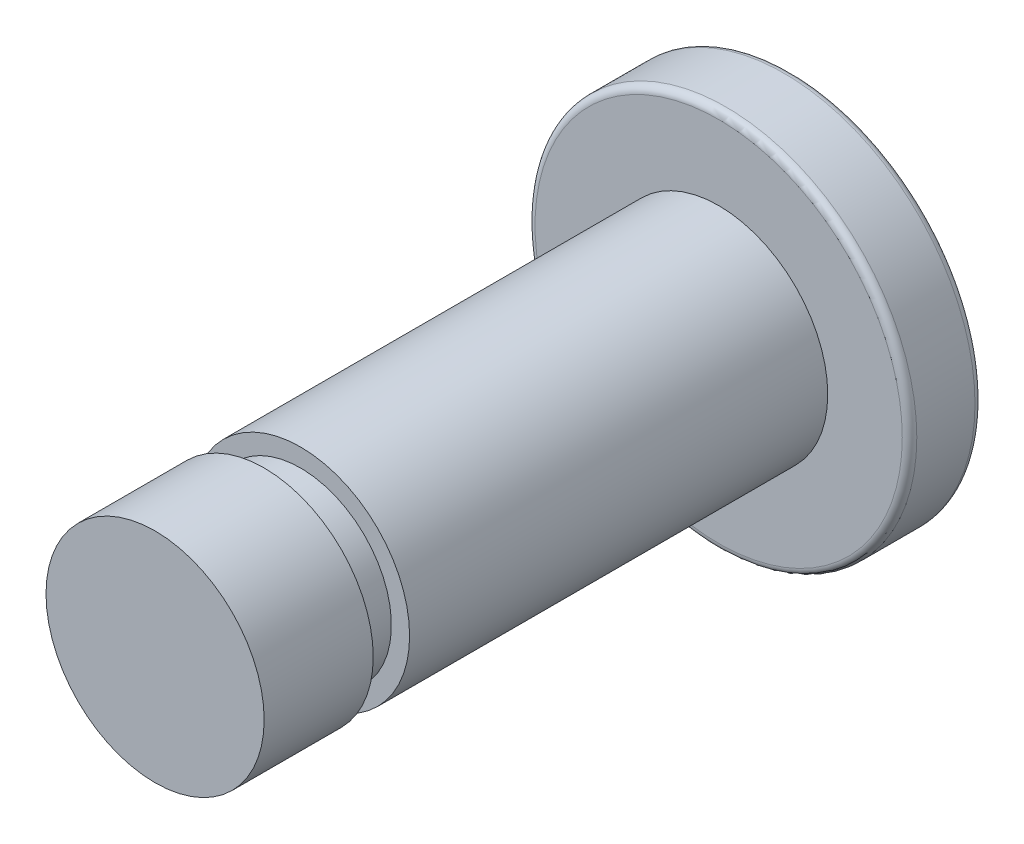
ISO-10303-21;
HEADER;
FILE_DESCRIPTION(('STEP AP214'),'2;1');
FILE_NAME('part.step','',(''),(''),'','','');
FILE_SCHEMA(('AUTOMOTIVE_DESIGN { 1 0 10303 214 1 1 1 1 }'));
ENDSEC;
DATA;
#1=APPLICATION_CONTEXT('core data for automotive mechanical design processes');
#2=APPLICATION_PROTOCOL_DEFINITION('international standard','automotive_design',2000,#1);
#3=PRODUCT_CONTEXT('',#1,'mechanical');
#4=PRODUCT('Part','Part','',(#3));
#5=PRODUCT_RELATED_PRODUCT_CATEGORY('part','',(#4));
#6=PRODUCT_DEFINITION_FORMATION('','',#4);
#7=PRODUCT_DEFINITION_CONTEXT('part definition',#1,'design');
#8=PRODUCT_DEFINITION('design','',#6,#7);
#9=PRODUCT_DEFINITION_SHAPE('','',#8);
#10=(LENGTH_UNIT() NAMED_UNIT(*) SI_UNIT(.MILLI.,.METRE.));
#11=(NAMED_UNIT(*) PLANE_ANGLE_UNIT() SI_UNIT($,.RADIAN.));
#12=(NAMED_UNIT(*) SI_UNIT($,.STERADIAN.) SOLID_ANGLE_UNIT());
#13=UNCERTAINTY_MEASURE_WITH_UNIT(LENGTH_MEASURE(1.E-05),#10,'distance_accuracy_value','');
#14=(GEOMETRIC_REPRESENTATION_CONTEXT(3) GLOBAL_UNCERTAINTY_ASSIGNED_CONTEXT((#13)) GLOBAL_UNIT_ASSIGNED_CONTEXT((#10,
#11,#12)) REPRESENTATION_CONTEXT('',''));
#15=CARTESIAN_POINT('',(0.,0.,0.));
#16=DIRECTION('',(0.,0.,1.));
#17=DIRECTION('',(1.,0.,0.));
#18=AXIS2_PLACEMENT_3D('',#15,#16,#17);
#19=CARTESIAN_POINT('',(3.,0.,0.));
#20=DIRECTION('',(0.,0.,1.));
#21=DIRECTION('',(1.,0.,0.));
#22=AXIS2_PLACEMENT_3D('',#19,#20,#21);
#23=PLANE('',#22);
#24=CARTESIAN_POINT('',(3.,0.,0.));
#25=DIRECTION('',(0.,0.,-1.));
#26=DIRECTION('',(-1.,0.,0.));
#27=AXIS2_PLACEMENT_3D('',#24,#25,#26);
#28=CIRCLE('',#27,3.);
#29=CARTESIAN_POINT('',(0.,0.,0.));
#30=VERTEX_POINT('',#29);
#31=EDGE_CURVE('E62',#30,#30,#28,.T.);
#32=ORIENTED_EDGE('',*,*,#31,.F.);
#33=EDGE_LOOP('',(#32));
#34=FACE_BOUND('',#33,.T.);
#35=ADVANCED_FACE('F42',(#34),#23,.T.);
#36=CARTESIAN_POINT('',(3.,0.,-17.5));
#37=DIRECTION('',(0.,0.,-1.));
#38=DIRECTION('',(-1.,0.,0.));
#39=AXIS2_PLACEMENT_3D('',#36,#37,#38);
#40=CYLINDRICAL_SURFACE('',#39,3.);
#41=ORIENTED_EDGE('',*,*,#31,.T.);
#42=EDGE_LOOP('',(#41));
#43=FACE_BOUND('',#42,.T.);
#44=CARTESIAN_POINT('',(3.,0.,-3.));
#45=DIRECTION('',(0.,0.,-1.));
#46=DIRECTION('',(-1.,0.,0.));
#47=AXIS2_PLACEMENT_3D('',#44,#45,#46);
#48=CIRCLE('',#47,3.);
#49=CARTESIAN_POINT('',(0.,0.,-3.));
#50=VERTEX_POINT('',#49);
#51=EDGE_CURVE('E65',#50,#50,#48,.T.);
#52=ORIENTED_EDGE('',*,*,#51,.F.);
#53=EDGE_LOOP('',(#52));
#54=FACE_BOUND('',#53,.T.);
#55=ADVANCED_FACE('F98',(#43,#54),#40,.T.);
#56=CARTESIAN_POINT('',(0.5,0.,-3.));
#57=DIRECTION('',(0.,0.,-1.));
#58=DIRECTION('',(-1.,0.,0.));
#59=AXIS2_PLACEMENT_3D('',#56,#57,#58);
#60=PLANE('',#59);
#61=ORIENTED_EDGE('',*,*,#51,.T.);
#62=EDGE_LOOP('',(#61));
#63=FACE_BOUND('',#62,.T.);
#64=CARTESIAN_POINT('',(3.,0.,-3.));
#65=DIRECTION('',(0.,0.,-1.));
#66=DIRECTION('',(-1.,0.,0.));
#67=AXIS2_PLACEMENT_3D('',#64,#65,#66);
#68=CIRCLE('',#67,2.5);
#69=CARTESIAN_POINT('',(0.5,0.,-3.));
#70=VERTEX_POINT('',#69);
#71=EDGE_CURVE('E68',#70,#70,#68,.T.);
#72=ORIENTED_EDGE('',*,*,#71,.F.);
#73=EDGE_LOOP('',(#72));
#74=FACE_BOUND('',#73,.T.);
#75=ADVANCED_FACE('F104',(#63,#74),#60,.T.);
#76=CARTESIAN_POINT('',(3.,0.,-17.5));
#77=DIRECTION('',(0.,0.,-1.));
#78=DIRECTION('',(-1.,0.,0.));
#79=AXIS2_PLACEMENT_3D('',#76,#77,#78);
#80=CYLINDRICAL_SURFACE('',#79,2.5);
#81=ORIENTED_EDGE('',*,*,#71,.T.);
#82=EDGE_LOOP('',(#81));
#83=FACE_BOUND('',#82,.T.);
#84=CARTESIAN_POINT('',(3.,0.,-4.));
#85=DIRECTION('',(0.,0.,-1.));
#86=DIRECTION('',(-1.,0.,0.));
#87=AXIS2_PLACEMENT_3D('',#84,#85,#86);
#88=CIRCLE('',#87,2.5);
#89=CARTESIAN_POINT('',(0.5,0.,-4.));
#90=VERTEX_POINT('',#89);
#91=EDGE_CURVE('E71',#90,#90,#88,.T.);
#92=ORIENTED_EDGE('',*,*,#91,.F.);
#93=EDGE_LOOP('',(#92));
#94=FACE_BOUND('',#93,.T.);
#95=ADVANCED_FACE('F94',(#83,#94),#80,.T.);
#96=CARTESIAN_POINT('',(0.,0.,-4.));
#97=DIRECTION('',(0.,0.,1.));
#98=DIRECTION('',(1.,0.,0.));
#99=AXIS2_PLACEMENT_3D('',#96,#97,#98);
#100=PLANE('',#99);
#101=ORIENTED_EDGE('',*,*,#91,.T.);
#102=EDGE_LOOP('',(#101));
#103=FACE_BOUND('',#102,.T.);
#104=CARTESIAN_POINT('',(3.,0.,-4.));
#105=DIRECTION('',(0.,0.,-1.));
#106=DIRECTION('',(-1.,0.,0.));
#107=AXIS2_PLACEMENT_3D('',#104,#105,#106);
#108=CIRCLE('',#107,3.);
#109=CARTESIAN_POINT('',(0.,0.,-4.));
#110=VERTEX_POINT('',#109);
#111=EDGE_CURVE('E74',#110,#110,#108,.T.);
#112=ORIENTED_EDGE('',*,*,#111,.F.);
#113=EDGE_LOOP('',(#112));
#114=FACE_BOUND('',#113,.T.);
#115=ADVANCED_FACE('F85',(#103,#114),#100,.T.);
#116=CARTESIAN_POINT('',(3.,0.,-17.5));
#117=DIRECTION('',(0.,0.,-1.));
#118=DIRECTION('',(-1.,0.,0.));
#119=AXIS2_PLACEMENT_3D('',#116,#117,#118);
#120=CYLINDRICAL_SURFACE('',#119,3.);
#121=ORIENTED_EDGE('',*,*,#111,.T.);
#122=EDGE_LOOP('',(#121));
#123=FACE_BOUND('',#122,.T.);
#124=CARTESIAN_POINT('',(3.,0.,-15.5));
#125=DIRECTION('',(0.,0.,-1.));
#126=DIRECTION('',(-1.,0.,0.));
#127=AXIS2_PLACEMENT_3D('',#124,#125,#126);
#128=CIRCLE('',#127,3.);
#129=CARTESIAN_POINT('',(0.,0.,-15.5));
#130=VERTEX_POINT('',#129);
#131=EDGE_CURVE('E77',#130,#130,#128,.T.);
#132=ORIENTED_EDGE('',*,*,#131,.F.);
#133=EDGE_LOOP('',(#132));
#134=FACE_BOUND('',#133,.T.);
#135=ADVANCED_FACE('F83',(#123,#134),#120,.T.);
#136=CARTESIAN_POINT('',(0.,0.,-15.5));
#137=DIRECTION('',(0.,0.,1.));
#138=DIRECTION('',(1.,0.,0.));
#139=AXIS2_PLACEMENT_3D('',#136,#137,#138);
#140=PLANE('',#139);
#141=CARTESIAN_POINT('',(3.,0.,-15.5));
#142=DIRECTION('',(0.,0.,1.));
#143=DIRECTION('',(1.,0.,0.));
#144=AXIS2_PLACEMENT_3D('',#141,#142,#143);
#145=CIRCLE('',#144,5.05);
#146=CARTESIAN_POINT('',(8.05,0.,-15.5));
#147=VERTEX_POINT('',#146);
#148=EDGE_CURVE('E49',#147,#147,#145,.T.);
#149=ORIENTED_EDGE('',*,*,#148,.T.);
#150=EDGE_LOOP('',(#149));
#151=FACE_BOUND('',#150,.T.);
#152=ORIENTED_EDGE('',*,*,#131,.T.);
#153=EDGE_LOOP('',(#152));
#154=FACE_BOUND('',#153,.T.);
#155=ADVANCED_FACE('F81',(#151,#154),#140,.T.);
#156=CARTESIAN_POINT('',(3.,0.,-17.5));
#157=DIRECTION('',(0.,0.,-1.));
#158=DIRECTION('',(-1.,0.,0.));
#159=AXIS2_PLACEMENT_3D('',#156,#157,#158);
#160=CYLINDRICAL_SURFACE('',#159,5.25);
#161=CARTESIAN_POINT('',(3.,0.,-15.7));
#162=DIRECTION('',(0.,0.,1.));
#163=DIRECTION('',(1.,0.,0.));
#164=AXIS2_PLACEMENT_3D('',#161,#162,#163);
#165=CIRCLE('',#164,5.25);
#166=CARTESIAN_POINT('',(8.25,0.,-15.7));
#167=VERTEX_POINT('',#166);
#168=EDGE_CURVE('E53',#167,#167,#165,.F.);
#169=ORIENTED_EDGE('',*,*,#168,.T.);
#170=EDGE_LOOP('',(#169));
#171=FACE_BOUND('',#170,.T.);
#172=CARTESIAN_POINT('',(3.,0.,-17.3));
#173=DIRECTION('',(0.,0.,-1.));
#174=DIRECTION('',(-1.,0.,0.));
#175=AXIS2_PLACEMENT_3D('',#172,#173,#174);
#176=CIRCLE('',#175,5.25);
#177=CARTESIAN_POINT('',(-2.25,0.,-17.3));
#178=VERTEX_POINT('',#177);
#179=EDGE_CURVE('E57',#178,#178,#176,.F.);
#180=ORIENTED_EDGE('',*,*,#179,.T.);
#181=EDGE_LOOP('',(#180));
#182=FACE_BOUND('',#181,.T.);
#183=ADVANCED_FACE('F92',(#171,#182),#160,.T.);
#184=CARTESIAN_POINT('',(-2.25,0.,-17.5));
#185=DIRECTION('',(0.,0.,-1.));
#186=DIRECTION('',(-1.,0.,0.));
#187=AXIS2_PLACEMENT_3D('',#184,#185,#186);
#188=PLANE('',#187);
#189=CARTESIAN_POINT('',(3.,0.,-17.5));
#190=DIRECTION('',(0.,0.,-1.));
#191=DIRECTION('',(-1.,0.,0.));
#192=AXIS2_PLACEMENT_3D('',#189,#190,#191);
#193=CIRCLE('',#192,5.05);
#194=CARTESIAN_POINT('',(-2.05,0.,-17.5));
#195=VERTEX_POINT('',#194);
#196=EDGE_CURVE('E12',#195,#195,#193,.T.);
#197=ORIENTED_EDGE('',*,*,#196,.T.);
#198=EDGE_LOOP('',(#197));
#199=FACE_BOUND('',#198,.T.);
#200=ADVANCED_FACE('F111',(#199),#188,.T.);
#201=CARTESIAN_POINT('',(3.,0.,-15.7));
#202=DIRECTION('',(0.,0.,1.));
#203=DIRECTION('',(1.,0.,0.));
#204=AXIS2_PLACEMENT_3D('',#201,#202,#203);
#205=TOROIDAL_SURFACE('',#204,5.05,0.2);
#206=ORIENTED_EDGE('',*,*,#148,.F.);
#207=EDGE_LOOP('',(#206));
#208=FACE_BOUND('',#207,.T.);
#209=ORIENTED_EDGE('',*,*,#168,.F.);
#210=EDGE_LOOP('',(#209));
#211=FACE_BOUND('',#210,.T.);
#212=ADVANCED_FACE('F109',(#208,#211),#205,.T.);
#213=CARTESIAN_POINT('',(3.,0.,-17.3));
#214=DIRECTION('',(0.,0.,-1.));
#215=DIRECTION('',(-1.,0.,0.));
#216=AXIS2_PLACEMENT_3D('',#213,#214,#215);
#217=TOROIDAL_SURFACE('',#216,5.05,0.2);
#218=ORIENTED_EDGE('',*,*,#179,.F.);
#219=EDGE_LOOP('',(#218));
#220=FACE_BOUND('',#219,.T.);
#221=ORIENTED_EDGE('',*,*,#196,.F.);
#222=EDGE_LOOP('',(#221));
#223=FACE_BOUND('',#222,.T.);
#224=ADVANCED_FACE('F44',(#220,#223),#217,.T.);
#225=CLOSED_SHELL('',(#35,#55,#75,#95,#115,#135,#155,#183,#200,#212,#224));
#226=MANIFOLD_SOLID_BREP('B2',#225);
#227=ADVANCED_BREP_SHAPE_REPRESENTATION('',(#18,#226),#14);
#228=SHAPE_DEFINITION_REPRESENTATION(#9,#227);
ENDSEC;
END-ISO-10303-21;
